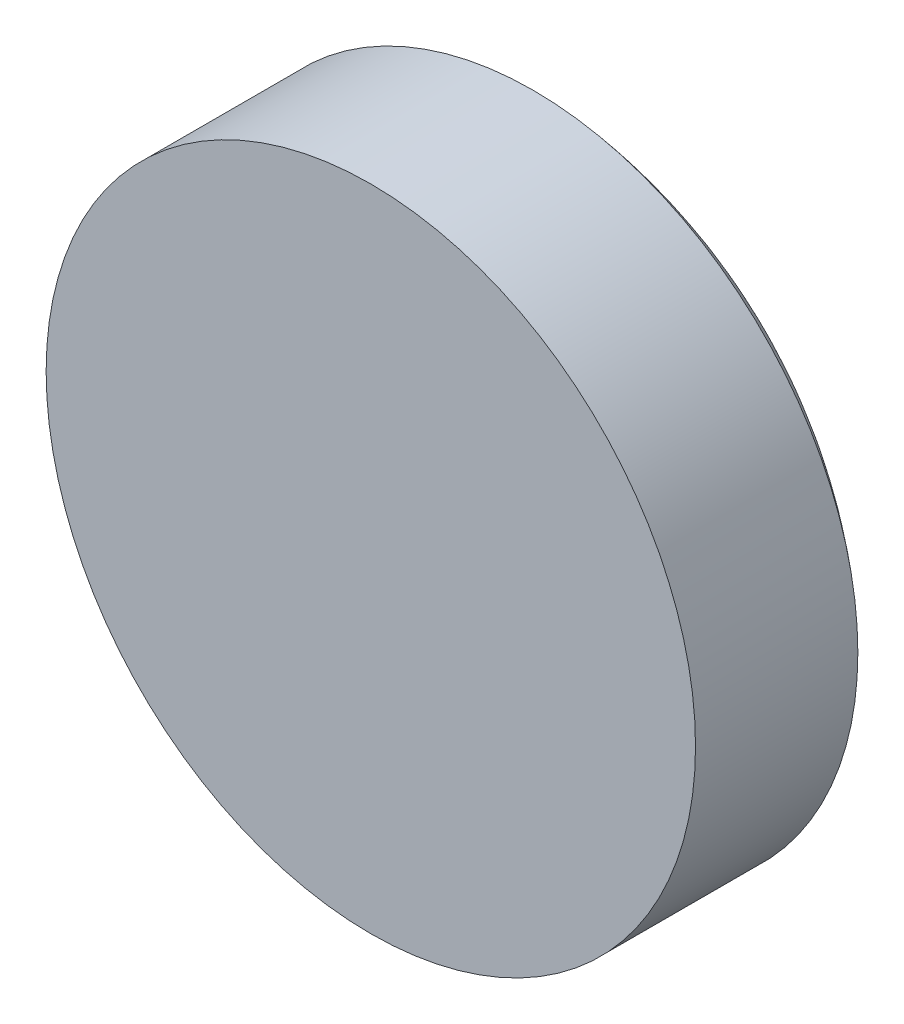
ISO-10303-21;
HEADER;
FILE_DESCRIPTION(('STEP AP214'),'2;1');
FILE_NAME('part.step','',(''),(''),'','','');
FILE_SCHEMA(('AUTOMOTIVE_DESIGN { 1 0 10303 214 1 1 1 1 }'));
ENDSEC;
DATA;
#1=APPLICATION_CONTEXT('core data for automotive mechanical design processes');
#2=APPLICATION_PROTOCOL_DEFINITION('international standard','automotive_design',2000,#1);
#3=PRODUCT_CONTEXT('',#1,'mechanical');
#4=PRODUCT('Part','Part','',(#3));
#5=PRODUCT_RELATED_PRODUCT_CATEGORY('part','',(#4));
#6=PRODUCT_DEFINITION_FORMATION('','',#4);
#7=PRODUCT_DEFINITION_CONTEXT('part definition',#1,'design');
#8=PRODUCT_DEFINITION('design','',#6,#7);
#9=PRODUCT_DEFINITION_SHAPE('','',#8);
#10=(LENGTH_UNIT() NAMED_UNIT(*) SI_UNIT(.MILLI.,.METRE.));
#11=(NAMED_UNIT(*) PLANE_ANGLE_UNIT() SI_UNIT($,.RADIAN.));
#12=(NAMED_UNIT(*) SI_UNIT($,.STERADIAN.) SOLID_ANGLE_UNIT());
#13=UNCERTAINTY_MEASURE_WITH_UNIT(LENGTH_MEASURE(1.E-05),#10,'distance_accuracy_value','');
#14=(GEOMETRIC_REPRESENTATION_CONTEXT(3) GLOBAL_UNCERTAINTY_ASSIGNED_CONTEXT((#13)) GLOBAL_UNIT_ASSIGNED_CONTEXT((#10,
#11,#12)) REPRESENTATION_CONTEXT('',''));
#15=CARTESIAN_POINT('',(0.,0.,0.));
#16=DIRECTION('',(0.,0.,1.));
#17=DIRECTION('',(1.,0.,0.));
#18=AXIS2_PLACEMENT_3D('',#15,#16,#17);
#19=CARTESIAN_POINT('',(0.,0.,0.));
#20=DIRECTION('',(0.,0.,-1.));
#21=DIRECTION('',(-1.,0.,0.));
#22=AXIS2_PLACEMENT_3D('',#19,#20,#21);
#23=PLANE('',#22);
#24=CARTESIAN_POINT('',(0.,0.,0.));
#25=DIRECTION('',(0.,0.,1.));
#26=DIRECTION('',(1.,0.,0.));
#27=AXIS2_PLACEMENT_3D('',#24,#25,#26);
#28=CIRCLE('',#27,3.);
#29=CARTESIAN_POINT('',(3.,0.,0.));
#30=VERTEX_POINT('',#29);
#31=EDGE_CURVE('E10',#30,#30,#28,.T.);
#32=ORIENTED_EDGE('',*,*,#31,.T.);
#33=EDGE_LOOP('',(#32));
#34=FACE_BOUND('',#33,.T.);
#35=ADVANCED_FACE('F16',(#34),#23,.F.);
#36=CARTESIAN_POINT('',(0.,0.,0.));
#37=DIRECTION('',(0.,0.,1.));
#38=DIRECTION('',(1.,0.,0.));
#39=AXIS2_PLACEMENT_3D('',#36,#37,#38);
#40=CYLINDRICAL_SURFACE('',#39,3.);
#41=ORIENTED_EDGE('',*,*,#31,.F.);
#42=EDGE_LOOP('',(#41));
#43=FACE_BOUND('',#42,.T.);
#44=CARTESIAN_POINT('',(0.,0.,-1.5));
#45=DIRECTION('',(0.,0.,1.));
#46=DIRECTION('',(1.,0.,0.));
#47=AXIS2_PLACEMENT_3D('',#44,#45,#46);
#48=CIRCLE('',#47,3.);
#49=CARTESIAN_POINT('',(3.,0.,-1.5));
#50=VERTEX_POINT('',#49);
#51=EDGE_CURVE('E22',#50,#50,#48,.T.);
#52=ORIENTED_EDGE('',*,*,#51,.T.);
#53=EDGE_LOOP('',(#52));
#54=FACE_BOUND('',#53,.T.);
#55=ADVANCED_FACE('F27',(#43,#54),#40,.T.);
#56=CARTESIAN_POINT('',(0.0150089781531611,0.,1.99997551412774));
#57=DIRECTION('',(0.,-1.,0.));
#58=DIRECTION('',(1.,0.,0.));
#59=AXIS2_PLACEMENT_3D('',#56,#57,#58);
#60=CIRCLE('',#59,4.6);
#61=TRIMMED_CURVE('',#60,(PARAMETER_VALUE(-1.5740591539219)),(PARAMETER_VALUE(1.5740591539219)),
.T.,.PARAMETER.);
#62=CARTESIAN_POINT('',(0.,0.,1.99997551412774));
#63=DIRECTION('',(0.,0.,1.));
#64=AXIS1_PLACEMENT('',#62,#63);
#65=SURFACE_OF_REVOLUTION('',#61,#64);
#66=ORIENTED_EDGE('',*,*,#51,.F.);
#67=EDGE_LOOP('',(#66));
#68=FACE_BOUND('',#67,.T.);
#69=CARTESIAN_POINT('',(0.,0.,-2.6));
#70=VERTEX_POINT('',#69);
#71=VERTEX_LOOP('',#70);
#72=FACE_BOUND('',#71,.T.);
#73=ADVANCED_FACE('F25',(#68,#72),#65,.T.);
#74=CLOSED_SHELL('',(#35,#55,#73));
#75=MANIFOLD_SOLID_BREP('B1',#74);
#76=ADVANCED_BREP_SHAPE_REPRESENTATION('',(#18,#75),#14);
#77=SHAPE_DEFINITION_REPRESENTATION(#9,#76);
ENDSEC;
END-ISO-10303-21;
